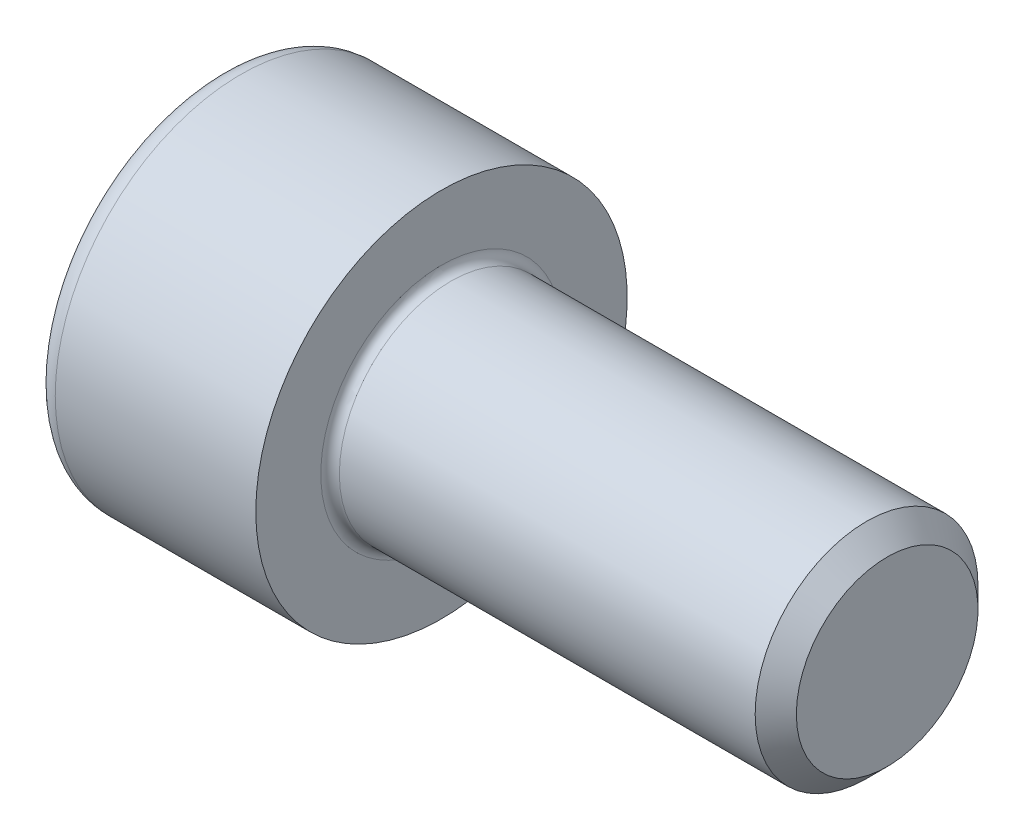
ISO-10303-21;
HEADER;
FILE_DESCRIPTION(('STEP AP214'),'2;1');
FILE_NAME('part.step','',(''),(''),'','','');
FILE_SCHEMA(('AUTOMOTIVE_DESIGN { 1 0 10303 214 1 1 1 1 }'));
ENDSEC;
DATA;
#1=APPLICATION_CONTEXT('core data for automotive mechanical design processes');
#2=APPLICATION_PROTOCOL_DEFINITION('international standard','automotive_design',2000,#1);
#3=PRODUCT_CONTEXT('',#1,'mechanical');
#4=PRODUCT('Part','Part','',(#3));
#5=PRODUCT_RELATED_PRODUCT_CATEGORY('part','',(#4));
#6=PRODUCT_DEFINITION_FORMATION('','',#4);
#7=PRODUCT_DEFINITION_CONTEXT('part definition',#1,'design');
#8=PRODUCT_DEFINITION('design','',#6,#7);
#9=PRODUCT_DEFINITION_SHAPE('','',#8);
#10=(LENGTH_UNIT() NAMED_UNIT(*) SI_UNIT(.MILLI.,.METRE.));
#11=(NAMED_UNIT(*) PLANE_ANGLE_UNIT() SI_UNIT($,.RADIAN.));
#12=(NAMED_UNIT(*) SI_UNIT($,.STERADIAN.) SOLID_ANGLE_UNIT());
#13=UNCERTAINTY_MEASURE_WITH_UNIT(LENGTH_MEASURE(1.E-05),#10,'distance_accuracy_value','');
#14=(GEOMETRIC_REPRESENTATION_CONTEXT(3) GLOBAL_UNCERTAINTY_ASSIGNED_CONTEXT((#13)) GLOBAL_UNIT_ASSIGNED_CONTEXT((#10,
#11,#12)) REPRESENTATION_CONTEXT('',''));
#15=CARTESIAN_POINT('',(0.,0.,0.));
#16=DIRECTION('',(0.,0.,1.));
#17=DIRECTION('',(1.,0.,0.));
#18=AXIS2_PLACEMENT_3D('',#15,#16,#17);
#19=CARTESIAN_POINT('',(0.,0.,0.));
#20=DIRECTION('',(-1.,0.,0.));
#21=DIRECTION('',(0.,0.,1.));
#22=AXIS2_PLACEMENT_3D('',#19,#20,#21);
#23=PLANE('',#22);
#24=DIRECTION('',(0.,-0.499999999999999,0.86602540378444));
#25=VECTOR('',#24,1.);
#26=CARTESIAN_POINT('',(0.,2.89829835133191,0.));
#27=LINE('',#26,#25);
#28=CARTESIAN_POINT('',(0.,2.89829835133191,0.));
#29=VERTEX_POINT('',#28);
#30=CARTESIAN_POINT('',(0.,1.44914917566596,2.51));
#31=VERTEX_POINT('',#30);
#32=EDGE_CURVE('E259',#29,#31,#27,.T.);
#33=ORIENTED_EDGE('',*,*,#32,.T.);
#34=DIRECTION('',(0.,1.,0.));
#35=VECTOR('',#34,1.);
#36=CARTESIAN_POINT('',(0.,-1.44914917566596,2.51));
#37=LINE('',#36,#35);
#38=CARTESIAN_POINT('',(0.,-1.44914917566596,2.51));
#39=VERTEX_POINT('',#38);
#40=EDGE_CURVE('E131',#39,#31,#37,.T.);
#41=ORIENTED_EDGE('',*,*,#40,.F.);
#42=DIRECTION('',(0.,-0.500000000000001,-0.866025403784438));
#43=VECTOR('',#42,1.);
#44=CARTESIAN_POINT('',(0.,-1.44914917566596,2.51));
#45=LINE('',#44,#43);
#46=CARTESIAN_POINT('',(0.,-2.89829835133192,0.));
#47=VERTEX_POINT('',#46);
#48=EDGE_CURVE('E262',#39,#47,#45,.T.);
#49=ORIENTED_EDGE('',*,*,#48,.T.);
#50=DIRECTION('',(0.,0.499999999999998,-0.86602540378444));
#51=VECTOR('',#50,1.);
#52=CARTESIAN_POINT('',(0.,-2.89829835133192,0.));
#53=LINE('',#52,#51);
#54=CARTESIAN_POINT('',(0.,-1.44914917566597,-2.51));
#55=VERTEX_POINT('',#54);
#56=EDGE_CURVE('E265',#47,#55,#53,.T.);
#57=ORIENTED_EDGE('',*,*,#56,.T.);
#58=DIRECTION('',(0.,-1.,0.));
#59=VECTOR('',#58,1.);
#60=CARTESIAN_POINT('',(0.,1.44914917566595,-2.51));
#61=LINE('',#60,#59);
#62=CARTESIAN_POINT('',(0.,1.44914917566595,-2.51));
#63=VERTEX_POINT('',#62);
#64=EDGE_CURVE('E268',#63,#55,#61,.T.);
#65=ORIENTED_EDGE('',*,*,#64,.F.);
#66=DIRECTION('',(0.,-0.500000000000001,-0.866025403784438));
#67=VECTOR('',#66,1.);
#68=CARTESIAN_POINT('',(0.,2.89829835133191,0.));
#69=LINE('',#68,#67);
#70=EDGE_CURVE('E126',#29,#63,#69,.T.);
#71=ORIENTED_EDGE('',*,*,#70,.F.);
#72=EDGE_LOOP('',(#33,#41,#49,#57,#65,#71));
#73=FACE_BOUND('',#72,.T.);
#74=CARTESIAN_POINT('',(0.,0.,0.));
#75=DIRECTION('',(-1.,0.,0.));
#76=DIRECTION('',(0.,0.,1.));
#77=AXIS2_PLACEMENT_3D('',#74,#75,#76);
#78=CIRCLE('',#77,4.4);
#79=CARTESIAN_POINT('',(0.,0.,4.4));
#80=VERTEX_POINT('',#79);
#81=EDGE_CURVE('E43',#80,#80,#78,.T.);
#82=ORIENTED_EDGE('',*,*,#81,.T.);
#83=EDGE_LOOP('',(#82));
#84=FACE_BOUND('',#83,.T.);
#85=ADVANCED_FACE('F35',(#73,#84),#23,.T.);
#86=CARTESIAN_POINT('',(-31.75,0.,0.));
#87=DIRECTION('',(-1.,0.,0.));
#88=DIRECTION('',(0.,0.,1.));
#89=AXIS2_PLACEMENT_3D('',#86,#87,#88);
#90=CYLINDRICAL_SURFACE('',#89,5.);
#91=CARTESIAN_POINT('',(0.600000000000003,0.,0.));
#92=DIRECTION('',(-1.,0.,0.));
#93=DIRECTION('',(0.,0.,1.));
#94=AXIS2_PLACEMENT_3D('',#91,#92,#93);
#95=CIRCLE('',#94,5.);
#96=CARTESIAN_POINT('',(0.600000000000003,0.,5.));
#97=VERTEX_POINT('',#96);
#98=EDGE_CURVE('E11',#97,#97,#95,.F.);
#99=ORIENTED_EDGE('',*,*,#98,.T.);
#100=EDGE_LOOP('',(#99));
#101=FACE_BOUND('',#100,.T.);
#102=CARTESIAN_POINT('',(6.,0.,0.));
#103=DIRECTION('',(-1.,0.,0.));
#104=DIRECTION('',(0.,0.,1.));
#105=AXIS2_PLACEMENT_3D('',#102,#103,#104);
#106=CIRCLE('',#105,5.);
#107=CARTESIAN_POINT('',(6.,0.,5.));
#108=VERTEX_POINT('',#107);
#109=EDGE_CURVE('E149',#108,#108,#106,.T.);
#110=ORIENTED_EDGE('',*,*,#109,.T.);
#111=EDGE_LOOP('',(#110));
#112=FACE_BOUND('',#111,.T.);
#113=ADVANCED_FACE('F173',(#101,#112),#90,.T.);
#114=CARTESIAN_POINT('',(6.,5.,0.));
#115=DIRECTION('',(1.,0.,0.));
#116=DIRECTION('',(0.,0.,-1.));
#117=AXIS2_PLACEMENT_3D('',#114,#115,#116);
#118=PLANE('',#117);
#119=CARTESIAN_POINT('',(6.,0.,0.));
#120=DIRECTION('',(1.,0.,0.));
#121=DIRECTION('',(0.,0.,-1.));
#122=AXIS2_PLACEMENT_3D('',#119,#120,#121);
#123=CIRCLE('',#122,3.24999999999999);
#124=CARTESIAN_POINT('',(6.,0.,-3.24999999999999));
#125=VERTEX_POINT('',#124);
#126=EDGE_CURVE('E152',#125,#125,#123,.F.);
#127=ORIENTED_EDGE('',*,*,#126,.T.);
#128=EDGE_LOOP('',(#127));
#129=FACE_BOUND('',#128,.T.);
#130=ORIENTED_EDGE('',*,*,#109,.F.);
#131=EDGE_LOOP('',(#130));
#132=FACE_BOUND('',#131,.T.);
#133=ADVANCED_FACE('F179',(#129,#132),#118,.T.);
#134=CARTESIAN_POINT('',(-31.75,0.,0.));
#135=DIRECTION('',(-1.,0.,0.));
#136=DIRECTION('',(0.,0.,1.));
#137=AXIS2_PLACEMENT_3D('',#134,#135,#136);
#138=CYLINDRICAL_SURFACE('',#137,2.99999999999999);
#139=CARTESIAN_POINT('',(6.25,0.,0.));
#140=DIRECTION('',(1.,0.,0.));
#141=DIRECTION('',(0.,0.,-1.));
#142=AXIS2_PLACEMENT_3D('',#139,#140,#141);
#143=CIRCLE('',#142,2.99999999999999);
#144=CARTESIAN_POINT('',(6.25,0.,-2.99999999999999));
#145=VERTEX_POINT('',#144);
#146=EDGE_CURVE('E155',#145,#145,#143,.T.);
#147=ORIENTED_EDGE('',*,*,#146,.T.);
#148=EDGE_LOOP('',(#147));
#149=FACE_BOUND('',#148,.T.);
#150=CARTESIAN_POINT('',(17.4455,0.,0.));
#151=DIRECTION('',(-1.,0.,0.));
#152=DIRECTION('',(0.,0.,1.));
#153=AXIS2_PLACEMENT_3D('',#150,#151,#152);
#154=CIRCLE('',#153,2.99999999999999);
#155=CARTESIAN_POINT('',(17.4455,0.,2.99999999999999));
#156=VERTEX_POINT('',#155);
#157=EDGE_CURVE('E146',#156,#156,#154,.T.);
#158=ORIENTED_EDGE('',*,*,#157,.T.);
#159=EDGE_LOOP('',(#158));
#160=FACE_BOUND('',#159,.T.);
#161=ADVANCED_FACE('F185',(#149,#160),#138,.T.);
#162=CARTESIAN_POINT('',(18.,0.,0.));
#163=DIRECTION('',(-1.,0.,0.));
#164=DIRECTION('',(0.,0.,1.));
#165=AXIS2_PLACEMENT_3D('',#162,#163,#164);
#166=CONICAL_SURFACE('',#165,2.4455,0.785398163397432);
#167=ORIENTED_EDGE('',*,*,#157,.F.);
#168=EDGE_LOOP('',(#167));
#169=FACE_BOUND('',#168,.T.);
#170=CARTESIAN_POINT('',(18.,0.,0.));
#171=DIRECTION('',(-1.,0.,0.));
#172=DIRECTION('',(0.,0.,1.));
#173=AXIS2_PLACEMENT_3D('',#170,#171,#172);
#174=CIRCLE('',#173,2.4455);
#175=CARTESIAN_POINT('',(18.,0.,2.4455));
#176=VERTEX_POINT('',#175);
#177=EDGE_CURVE('E142',#176,#176,#174,.T.);
#178=ORIENTED_EDGE('',*,*,#177,.T.);
#179=EDGE_LOOP('',(#178));
#180=FACE_BOUND('',#179,.T.);
#181=ADVANCED_FACE('F189',(#169,#180),#166,.T.);
#182=CARTESIAN_POINT('',(18.,2.4455,0.));
#183=DIRECTION('',(1.,0.,0.));
#184=DIRECTION('',(0.,0.,-1.));
#185=AXIS2_PLACEMENT_3D('',#182,#183,#184);
#186=PLANE('',#185);
#187=ORIENTED_EDGE('',*,*,#177,.F.);
#188=EDGE_LOOP('',(#187));
#189=FACE_BOUND('',#188,.T.);
#190=ADVANCED_FACE('F169',(#189),#186,.T.);
#191=CARTESIAN_POINT('',(6.25,0.,0.));
#192=DIRECTION('',(1.,0.,0.));
#193=DIRECTION('',(0.,0.,-1.));
#194=AXIS2_PLACEMENT_3D('',#191,#192,#193);
#195=TOROIDAL_SURFACE('',#194,3.24999999999999,0.25);
#196=ORIENTED_EDGE('',*,*,#146,.F.);
#197=EDGE_LOOP('',(#196));
#198=FACE_BOUND('',#197,.T.);
#199=ORIENTED_EDGE('',*,*,#126,.F.);
#200=EDGE_LOOP('',(#199));
#201=FACE_BOUND('',#200,.T.);
#202=ADVANCED_FACE('F162',(#198,#201),#195,.F.);
#203=CARTESIAN_POINT('',(0.600000000000003,0.,0.));
#204=DIRECTION('',(-1.,0.,0.));
#205=DIRECTION('',(0.,0.,1.));
#206=AXIS2_PLACEMENT_3D('',#203,#204,#205);
#207=TOROIDAL_SURFACE('',#206,4.4,0.6);
#208=ORIENTED_EDGE('',*,*,#98,.F.);
#209=EDGE_LOOP('',(#208));
#210=FACE_BOUND('',#209,.T.);
#211=ORIENTED_EDGE('',*,*,#81,.F.);
#212=EDGE_LOOP('',(#211));
#213=FACE_BOUND('',#212,.T.);
#214=ADVANCED_FACE('F37',(#210,#213),#207,.T.);
#215=CARTESIAN_POINT('',(3.,2.89829835133191,0.));
#216=DIRECTION('',(0.,-0.866025403784439,-0.499999999999998));
#217=DIRECTION('',(0.,0.499999999999999,-0.86602540378444));
#218=AXIS2_PLACEMENT_3D('',#215,#216,#217);
#219=PLANE('',#218);
#220=ORIENTED_EDGE('',*,*,#32,.F.);
#221=DIRECTION('',(-1.,0.,0.));
#222=VECTOR('',#221,1.);
#223=CARTESIAN_POINT('',(3.,2.89829835133191,0.));
#224=LINE('',#223,#222);
#225=CARTESIAN_POINT('',(3.,2.89829835133191,0.));
#226=VERTEX_POINT('',#225);
#227=EDGE_CURVE('E249',#226,#29,#224,.T.);
#228=ORIENTED_EDGE('',*,*,#227,.F.);
#229=DIRECTION('',(0.,-0.499999999999999,0.86602540378444));
#230=VECTOR('',#229,1.);
#231=CARTESIAN_POINT('',(3.,2.89829835133191,0.));
#232=LINE('',#231,#230);
#233=CARTESIAN_POINT('',(3.,2.17372376349894,1.25499999999999));
#234=VERTEX_POINT('',#233);
#235=EDGE_CURVE('E118',#226,#234,#232,.T.);
#236=ORIENTED_EDGE('',*,*,#235,.T.);
#237=CARTESIAN_POINT('',(3.,1.44914917566596,2.51));
#238=VERTEX_POINT('',#237);
#239=EDGE_CURVE('E109',#234,#238,#232,.T.);
#240=ORIENTED_EDGE('',*,*,#239,.T.);
#241=DIRECTION('',(-1.,0.,0.));
#242=VECTOR('',#241,1.);
#243=CARTESIAN_POINT('',(3.,1.44914917566596,2.51));
#244=LINE('',#243,#242);
#245=EDGE_CURVE('E123',#238,#31,#244,.T.);
#246=ORIENTED_EDGE('',*,*,#245,.T.);
#247=EDGE_LOOP('',(#220,#228,#236,#240,#246));
#248=FACE_BOUND('',#247,.T.);
#249=ADVANCED_FACE('F122',(#248),#219,.T.);
#250=CARTESIAN_POINT('',(3.,-1.44914917566596,2.51));
#251=DIRECTION('',(0.,0.,1.));
#252=DIRECTION('',(0.,-1.,0.));
#253=AXIS2_PLACEMENT_3D('',#250,#251,#252);
#254=PLANE('',#253);
#255=ORIENTED_EDGE('',*,*,#40,.T.);
#256=ORIENTED_EDGE('',*,*,#245,.F.);
#257=DIRECTION('',(0.,1.,0.));
#258=VECTOR('',#257,1.);
#259=CARTESIAN_POINT('',(3.,-1.44914917566596,2.51));
#260=LINE('',#259,#258);
#261=CARTESIAN_POINT('',(3.,0.,2.51));
#262=VERTEX_POINT('',#261);
#263=EDGE_CURVE('E106',#262,#238,#260,.T.);
#264=ORIENTED_EDGE('',*,*,#263,.F.);
#265=CARTESIAN_POINT('',(3.,-1.44914917566596,2.51));
#266=VERTEX_POINT('',#265);
#267=EDGE_CURVE('E117',#266,#262,#260,.T.);
#268=ORIENTED_EDGE('',*,*,#267,.F.);
#269=DIRECTION('',(-1.,0.,0.));
#270=VECTOR('',#269,1.);
#271=CARTESIAN_POINT('',(3.,-1.44914917566596,2.51));
#272=LINE('',#271,#270);
#273=EDGE_CURVE('E133',#266,#39,#272,.T.);
#274=ORIENTED_EDGE('',*,*,#273,.T.);
#275=EDGE_LOOP('',(#255,#256,#264,#268,#274));
#276=FACE_BOUND('',#275,.T.);
#277=ADVANCED_FACE('F128',(#276),#254,.F.);
#278=CARTESIAN_POINT('',(3.,-1.44914917566596,2.51));
#279=DIRECTION('',(0.,0.866025403784438,-0.500000000000001));
#280=DIRECTION('',(0.,0.500000000000001,0.866025403784438));
#281=AXIS2_PLACEMENT_3D('',#278,#279,#280);
#282=PLANE('',#281);
#283=ORIENTED_EDGE('',*,*,#48,.F.);
#284=ORIENTED_EDGE('',*,*,#273,.F.);
#285=DIRECTION('',(0.,-0.500000000000001,-0.866025403784438));
#286=VECTOR('',#285,1.);
#287=CARTESIAN_POINT('',(3.,-1.44914917566596,2.51));
#288=LINE('',#287,#286);
#289=CARTESIAN_POINT('',(3.,-2.17372376349894,1.255));
#290=VERTEX_POINT('',#289);
#291=EDGE_CURVE('E288',#266,#290,#288,.T.);
#292=ORIENTED_EDGE('',*,*,#291,.T.);
#293=CARTESIAN_POINT('',(3.,-2.89829835133192,0.));
#294=VERTEX_POINT('',#293);
#295=EDGE_CURVE('E277',#290,#294,#288,.T.);
#296=ORIENTED_EDGE('',*,*,#295,.T.);
#297=DIRECTION('',(-1.,0.,0.));
#298=VECTOR('',#297,1.);
#299=CARTESIAN_POINT('',(3.,-2.89829835133192,0.));
#300=LINE('',#299,#298);
#301=EDGE_CURVE('E138',#294,#47,#300,.T.);
#302=ORIENTED_EDGE('',*,*,#301,.T.);
#303=EDGE_LOOP('',(#283,#284,#292,#296,#302));
#304=FACE_BOUND('',#303,.T.);
#305=ADVANCED_FACE('F203',(#304),#282,.T.);
#306=CARTESIAN_POINT('',(3.,-2.89829835133192,0.));
#307=DIRECTION('',(0.,0.86602540378444,0.499999999999998));
#308=DIRECTION('',(0.,-0.499999999999998,0.86602540378444));
#309=AXIS2_PLACEMENT_3D('',#306,#307,#308);
#310=PLANE('',#309);
#311=ORIENTED_EDGE('',*,*,#56,.F.);
#312=ORIENTED_EDGE('',*,*,#301,.F.);
#313=DIRECTION('',(0.,0.499999999999998,-0.86602540378444));
#314=VECTOR('',#313,1.);
#315=CARTESIAN_POINT('',(3.,-2.89829835133192,0.));
#316=LINE('',#315,#314);
#317=CARTESIAN_POINT('',(3.,-2.17372376349895,-1.255));
#318=VERTEX_POINT('',#317);
#319=EDGE_CURVE('E255',#294,#318,#316,.T.);
#320=ORIENTED_EDGE('',*,*,#319,.T.);
#321=CARTESIAN_POINT('',(3.,-1.44914917566597,-2.51));
#322=VERTEX_POINT('',#321);
#323=EDGE_CURVE('E287',#318,#322,#316,.T.);
#324=ORIENTED_EDGE('',*,*,#323,.T.);
#325=DIRECTION('',(-1.,0.,0.));
#326=VECTOR('',#325,1.);
#327=CARTESIAN_POINT('',(3.,-1.44914917566597,-2.51));
#328=LINE('',#327,#326);
#329=EDGE_CURVE('E248',#322,#55,#328,.T.);
#330=ORIENTED_EDGE('',*,*,#329,.T.);
#331=EDGE_LOOP('',(#311,#312,#320,#324,#330));
#332=FACE_BOUND('',#331,.T.);
#333=ADVANCED_FACE('F206',(#332),#310,.T.);
#334=CARTESIAN_POINT('',(3.,1.44914917566595,-2.51));
#335=DIRECTION('',(0.,0.,-1.));
#336=DIRECTION('',(0.,1.,0.));
#337=AXIS2_PLACEMENT_3D('',#334,#335,#336);
#338=PLANE('',#337);
#339=ORIENTED_EDGE('',*,*,#64,.T.);
#340=ORIENTED_EDGE('',*,*,#329,.F.);
#341=DIRECTION('',(0.,-1.,0.));
#342=VECTOR('',#341,1.);
#343=CARTESIAN_POINT('',(3.,1.44914917566595,-2.51));
#344=LINE('',#343,#342);
#345=CARTESIAN_POINT('',(3.,0.,-2.51));
#346=VERTEX_POINT('',#345);
#347=EDGE_CURVE('E252',#346,#322,#344,.T.);
#348=ORIENTED_EDGE('',*,*,#347,.F.);
#349=CARTESIAN_POINT('',(3.,1.44914917566595,-2.51));
#350=VERTEX_POINT('',#349);
#351=EDGE_CURVE('E50',#350,#346,#344,.T.);
#352=ORIENTED_EDGE('',*,*,#351,.F.);
#353=DIRECTION('',(-1.,0.,0.));
#354=VECTOR('',#353,1.);
#355=CARTESIAN_POINT('',(3.,1.44914917566595,-2.51));
#356=LINE('',#355,#354);
#357=EDGE_CURVE('E245',#350,#63,#356,.T.);
#358=ORIENTED_EDGE('',*,*,#357,.T.);
#359=EDGE_LOOP('',(#339,#340,#348,#352,#358));
#360=FACE_BOUND('',#359,.T.);
#361=ADVANCED_FACE('F210',(#360),#338,.F.);
#362=CARTESIAN_POINT('',(3.,2.89829835133191,0.));
#363=DIRECTION('',(0.,0.866025403784438,-0.500000000000001));
#364=DIRECTION('',(0.,0.500000000000001,0.866025403784438));
#365=AXIS2_PLACEMENT_3D('',#362,#363,#364);
#366=PLANE('',#365);
#367=ORIENTED_EDGE('',*,*,#70,.T.);
#368=ORIENTED_EDGE('',*,*,#357,.F.);
#369=DIRECTION('',(0.,-0.500000000000001,-0.866025403784438));
#370=VECTOR('',#369,1.);
#371=CARTESIAN_POINT('',(3.,2.89829835133191,0.));
#372=LINE('',#371,#370);
#373=CARTESIAN_POINT('',(3.,2.17372376349893,-1.255));
#374=VERTEX_POINT('',#373);
#375=EDGE_CURVE('E235',#374,#350,#372,.T.);
#376=ORIENTED_EDGE('',*,*,#375,.F.);
#377=EDGE_CURVE('E241',#226,#374,#372,.T.);
#378=ORIENTED_EDGE('',*,*,#377,.F.);
#379=ORIENTED_EDGE('',*,*,#227,.T.);
#380=EDGE_LOOP('',(#367,#368,#376,#378,#379));
#381=FACE_BOUND('',#380,.T.);
#382=ADVANCED_FACE('F214',(#381),#366,.F.);
#383=CARTESIAN_POINT('',(3.,4.34744752699787,-2.51000000000001));
#384=DIRECTION('',(1.,0.,0.));
#385=DIRECTION('',(0.,0.,-1.));
#386=AXIS2_PLACEMENT_3D('',#383,#384,#385);
#387=PLANE('',#386);
#388=ORIENTED_EDGE('',*,*,#347,.T.);
#389=ORIENTED_EDGE('',*,*,#323,.F.);
#390=CARTESIAN_POINT('',(3.,0.,0.));
#391=DIRECTION('',(-1.,0.,0.));
#392=DIRECTION('',(0.,0.,1.));
#393=AXIS2_PLACEMENT_3D('',#390,#391,#392);
#394=CIRCLE('',#393,2.51);
#395=EDGE_CURVE('E283',#346,#318,#394,.T.);
#396=ORIENTED_EDGE('',*,*,#395,.F.);
#397=EDGE_LOOP('',(#388,#389,#396));
#398=FACE_BOUND('',#397,.T.);
#399=ADVANCED_FACE('F218',(#398),#387,.F.);
#400=ORIENTED_EDGE('',*,*,#319,.F.);
#401=ORIENTED_EDGE('',*,*,#295,.F.);
#402=EDGE_CURVE('E136',#318,#290,#394,.T.);
#403=ORIENTED_EDGE('',*,*,#402,.F.);
#404=EDGE_LOOP('',(#400,#401,#403));
#405=FACE_BOUND('',#404,.T.);
#406=ADVANCED_FACE('F221',(#405),#387,.F.);
#407=ORIENTED_EDGE('',*,*,#291,.F.);
#408=ORIENTED_EDGE('',*,*,#267,.T.);
#409=EDGE_CURVE('E132',#290,#262,#394,.T.);
#410=ORIENTED_EDGE('',*,*,#409,.F.);
#411=EDGE_LOOP('',(#407,#408,#410));
#412=FACE_BOUND('',#411,.T.);
#413=ADVANCED_FACE('F226',(#412),#387,.F.);
#414=ORIENTED_EDGE('',*,*,#263,.T.);
#415=ORIENTED_EDGE('',*,*,#239,.F.);
#416=EDGE_CURVE('E112',#262,#234,#394,.T.);
#417=ORIENTED_EDGE('',*,*,#416,.F.);
#418=EDGE_LOOP('',(#414,#415,#417));
#419=FACE_BOUND('',#418,.T.);
#420=ADVANCED_FACE('F108',(#419),#387,.F.);
#421=ORIENTED_EDGE('',*,*,#235,.F.);
#422=ORIENTED_EDGE('',*,*,#377,.T.);
#423=EDGE_CURVE('E143',#234,#374,#394,.T.);
#424=ORIENTED_EDGE('',*,*,#423,.F.);
#425=EDGE_LOOP('',(#421,#422,#424));
#426=FACE_BOUND('',#425,.T.);
#427=ADVANCED_FACE('F229',(#426),#387,.F.);
#428=ORIENTED_EDGE('',*,*,#375,.T.);
#429=ORIENTED_EDGE('',*,*,#351,.T.);
#430=EDGE_CURVE('E238',#374,#346,#394,.T.);
#431=ORIENTED_EDGE('',*,*,#430,.F.);
#432=EDGE_LOOP('',(#428,#429,#431));
#433=FACE_BOUND('',#432,.T.);
#434=ADVANCED_FACE('F199',(#433),#387,.F.);
#435=CARTESIAN_POINT('',(3.,0.,0.));
#436=DIRECTION('',(-1.,0.,0.));
#437=DIRECTION('',(0.,0.,1.));
#438=AXIS2_PLACEMENT_3D('',#435,#436,#437);
#439=CONICAL_SURFACE('',#438,2.51,1.04719755119659);
#440=CARTESIAN_POINT('',(4.44914917566598,0.,0.));
#441=VERTEX_POINT('',#440);
#442=VERTEX_LOOP('',#441);
#443=FACE_BOUND('',#442,.T.);
#444=ORIENTED_EDGE('',*,*,#416,.T.);
#445=ORIENTED_EDGE('',*,*,#423,.T.);
#446=ORIENTED_EDGE('',*,*,#430,.T.);
#447=ORIENTED_EDGE('',*,*,#395,.T.);
#448=ORIENTED_EDGE('',*,*,#402,.T.);
#449=ORIENTED_EDGE('',*,*,#409,.T.);
#450=EDGE_LOOP('',(#444,#445,#446,#447,#448,#449));
#451=FACE_BOUND('',#450,.T.);
#452=ADVANCED_FACE('F197',(#443,#451),#439,.F.);
#453=CLOSED_SHELL('',(#85,#113,#133,#161,#181,#190,#202,#214,#249,#277,#305,#333,#361,#382,#399,
#406,#413,#420,#427,#434,#452));
#454=MANIFOLD_SOLID_BREP('B2',#453);
#455=ADVANCED_BREP_SHAPE_REPRESENTATION('',(#18,#454),#14);
#456=SHAPE_DEFINITION_REPRESENTATION(#9,#455);
ENDSEC;
END-ISO-10303-21;
